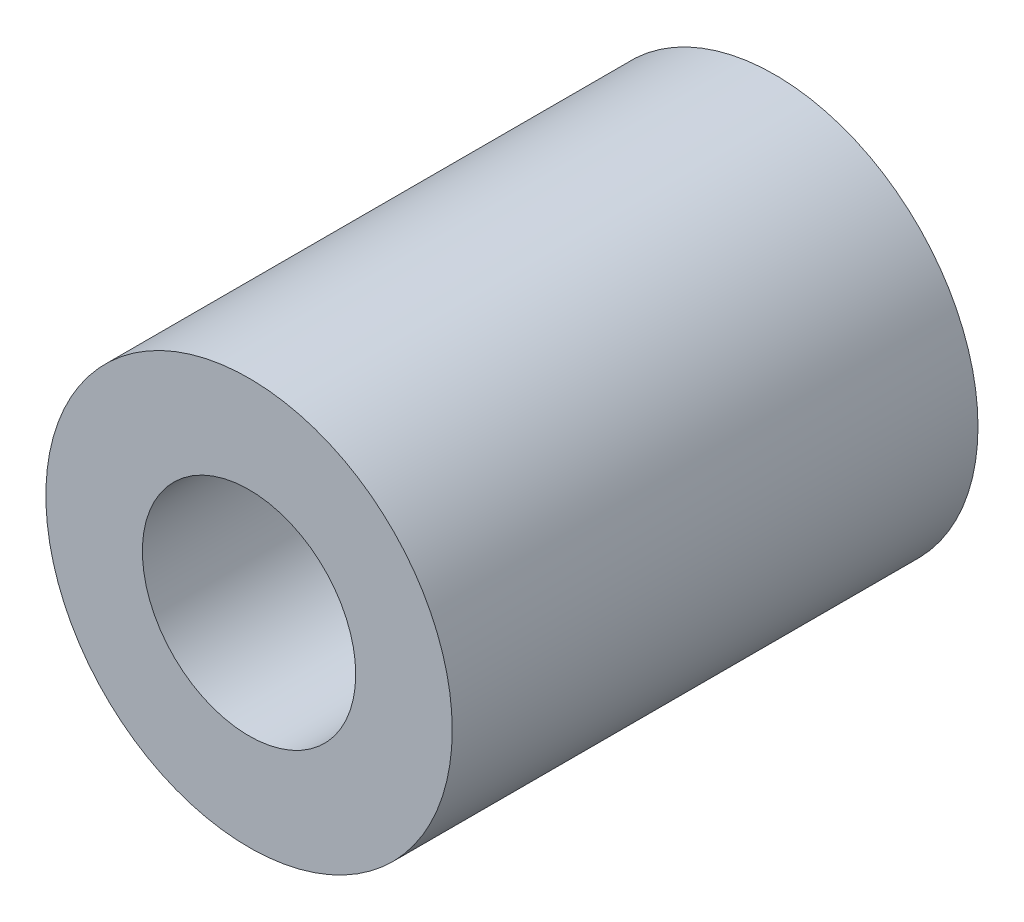
ISO-10303-21;
HEADER;
FILE_DESCRIPTION(('STEP AP214'),'2;1');
FILE_NAME('part.step','',(''),(''),'','','');
FILE_SCHEMA(('AUTOMOTIVE_DESIGN { 1 0 10303 214 1 1 1 1 }'));
ENDSEC;
DATA;
#1=APPLICATION_CONTEXT('core data for automotive mechanical design processes');
#2=APPLICATION_PROTOCOL_DEFINITION('international standard','automotive_design',2000,#1);
#3=PRODUCT_CONTEXT('',#1,'mechanical');
#4=PRODUCT('Part','Part','',(#3));
#5=PRODUCT_RELATED_PRODUCT_CATEGORY('part','',(#4));
#6=PRODUCT_DEFINITION_FORMATION('','',#4);
#7=PRODUCT_DEFINITION_CONTEXT('part definition',#1,'design');
#8=PRODUCT_DEFINITION('design','',#6,#7);
#9=PRODUCT_DEFINITION_SHAPE('','',#8);
#10=(LENGTH_UNIT() NAMED_UNIT(*) SI_UNIT(.MILLI.,.METRE.));
#11=(NAMED_UNIT(*) PLANE_ANGLE_UNIT() SI_UNIT($,.RADIAN.));
#12=(NAMED_UNIT(*) SI_UNIT($,.STERADIAN.) SOLID_ANGLE_UNIT());
#13=UNCERTAINTY_MEASURE_WITH_UNIT(LENGTH_MEASURE(1.E-05),#10,'distance_accuracy_value','');
#14=(GEOMETRIC_REPRESENTATION_CONTEXT(3) GLOBAL_UNCERTAINTY_ASSIGNED_CONTEXT((#13)) GLOBAL_UNIT_ASSIGNED_CONTEXT((#10,
#11,#12)) REPRESENTATION_CONTEXT('',''));
#15=CARTESIAN_POINT('',(0.,0.,0.));
#16=DIRECTION('',(0.,0.,1.));
#17=DIRECTION('',(1.,0.,0.));
#18=AXIS2_PLACEMENT_3D('',#15,#16,#17);
#19=CARTESIAN_POINT('',(0.,0.,10.35));
#20=DIRECTION('',(0.,0.,1.));
#21=DIRECTION('',(1.,0.,0.));
#22=AXIS2_PLACEMENT_3D('',#19,#20,#21);
#23=PLANE('',#22);
#24=CARTESIAN_POINT('',(0.,0.,10.35));
#25=DIRECTION('',(0.,0.,1.));
#26=DIRECTION('',(1.,0.,0.));
#27=AXIS2_PLACEMENT_3D('',#24,#25,#26);
#28=CIRCLE('',#27,4.);
#29=CARTESIAN_POINT('',(4.,0.,10.35));
#30=VERTEX_POINT('',#29);
#31=EDGE_CURVE('E10',#30,#30,#28,.T.);
#32=ORIENTED_EDGE('',*,*,#31,.T.);
#33=EDGE_LOOP('',(#32));
#34=FACE_BOUND('',#33,.T.);
#35=CARTESIAN_POINT('',(0.,0.,10.35));
#36=DIRECTION('',(0.,0.,1.));
#37=DIRECTION('',(1.,0.,0.));
#38=AXIS2_PLACEMENT_3D('',#35,#36,#37);
#39=CIRCLE('',#38,2.1);
#40=CARTESIAN_POINT('',(2.1,0.,10.35));
#41=VERTEX_POINT('',#40);
#42=EDGE_CURVE('E42',#41,#41,#39,.T.);
#43=ORIENTED_EDGE('',*,*,#42,.F.);
#44=EDGE_LOOP('',(#43));
#45=FACE_BOUND('',#44,.T.);
#46=ADVANCED_FACE('F31',(#34,#45),#23,.T.);
#47=CARTESIAN_POINT('',(0.,0.,0.));
#48=DIRECTION('',(0.,0.,1.));
#49=DIRECTION('',(1.,0.,0.));
#50=AXIS2_PLACEMENT_3D('',#47,#48,#49);
#51=PLANE('',#50);
#52=CARTESIAN_POINT('',(0.,0.,0.));
#53=DIRECTION('',(0.,0.,1.));
#54=DIRECTION('',(1.,0.,0.));
#55=AXIS2_PLACEMENT_3D('',#52,#53,#54);
#56=CIRCLE('',#55,4.);
#57=CARTESIAN_POINT('',(4.,0.,0.));
#58=VERTEX_POINT('',#57);
#59=EDGE_CURVE('E35',#58,#58,#56,.T.);
#60=ORIENTED_EDGE('',*,*,#59,.F.);
#61=EDGE_LOOP('',(#60));
#62=FACE_BOUND('',#61,.T.);
#63=CARTESIAN_POINT('',(0.,0.,0.));
#64=DIRECTION('',(0.,0.,1.));
#65=DIRECTION('',(1.,0.,0.));
#66=AXIS2_PLACEMENT_3D('',#63,#64,#65);
#67=CIRCLE('',#66,2.1);
#68=CARTESIAN_POINT('',(2.1,0.,0.));
#69=VERTEX_POINT('',#68);
#70=EDGE_CURVE('E44',#69,#69,#67,.T.);
#71=ORIENTED_EDGE('',*,*,#70,.T.);
#72=EDGE_LOOP('',(#71));
#73=FACE_BOUND('',#72,.T.);
#74=ADVANCED_FACE('F54',(#62,#73),#51,.F.);
#75=CARTESIAN_POINT('',(0.,0.,10.35));
#76=DIRECTION('',(0.,0.,-1.));
#77=DIRECTION('',(-1.,0.,0.));
#78=AXIS2_PLACEMENT_3D('',#75,#76,#77);
#79=CYLINDRICAL_SURFACE('',#78,4.);
#80=ORIENTED_EDGE('',*,*,#31,.F.);
#81=EDGE_LOOP('',(#80));
#82=FACE_BOUND('',#81,.T.);
#83=ORIENTED_EDGE('',*,*,#59,.T.);
#84=EDGE_LOOP('',(#83));
#85=FACE_BOUND('',#84,.T.);
#86=ADVANCED_FACE('F33',(#82,#85),#79,.T.);
#87=CARTESIAN_POINT('',(0.,0.,10.35));
#88=DIRECTION('',(0.,0.,-1.));
#89=DIRECTION('',(-1.,0.,0.));
#90=AXIS2_PLACEMENT_3D('',#87,#88,#89);
#91=CYLINDRICAL_SURFACE('',#90,2.1);
#92=ORIENTED_EDGE('',*,*,#42,.T.);
#93=EDGE_LOOP('',(#92));
#94=FACE_BOUND('',#93,.T.);
#95=ORIENTED_EDGE('',*,*,#70,.F.);
#96=EDGE_LOOP('',(#95));
#97=FACE_BOUND('',#96,.T.);
#98=ADVANCED_FACE('F50',(#94,#97),#91,.F.);
#99=CLOSED_SHELL('',(#46,#74,#86,#98));
#100=MANIFOLD_SOLID_BREP('B2',#99);
#101=ADVANCED_BREP_SHAPE_REPRESENTATION('',(#18,#100),#14);
#102=SHAPE_DEFINITION_REPRESENTATION(#9,#101);
ENDSEC;
END-ISO-10303-21;
